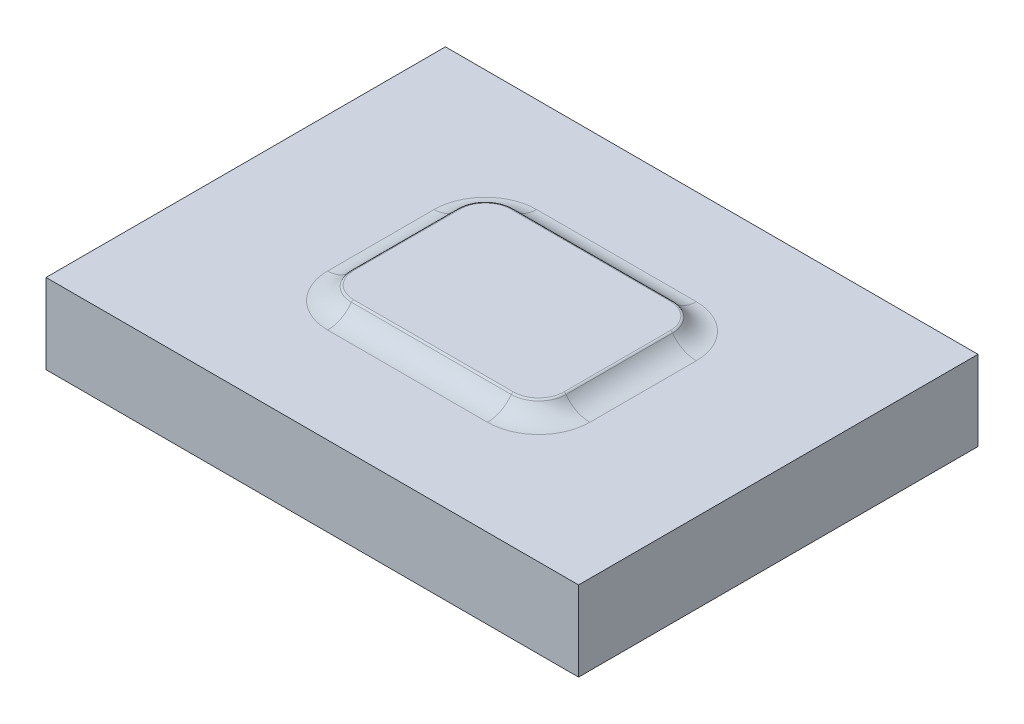
ISO-10303-21;
HEADER;
FILE_DESCRIPTION(('STEP AP214'),'2;1');
FILE_NAME('part.step','',(''),(''),'','','');
FILE_SCHEMA(('AUTOMOTIVE_DESIGN { 1 0 10303 214 1 1 1 1 }'));
ENDSEC;
DATA;
#1=APPLICATION_CONTEXT('core data for automotive mechanical design processes');
#2=APPLICATION_PROTOCOL_DEFINITION('international standard','automotive_design',2000,#1);
#3=PRODUCT_CONTEXT('',#1,'mechanical');
#4=PRODUCT('Part','Part','',(#3));
#5=PRODUCT_RELATED_PRODUCT_CATEGORY('part','',(#4));
#6=PRODUCT_DEFINITION_FORMATION('','',#4);
#7=PRODUCT_DEFINITION_CONTEXT('part definition',#1,'design');
#8=PRODUCT_DEFINITION('design','',#6,#7);
#9=PRODUCT_DEFINITION_SHAPE('','',#8);
#10=(LENGTH_UNIT() NAMED_UNIT(*) SI_UNIT(.MILLI.,.METRE.));
#11=(NAMED_UNIT(*) PLANE_ANGLE_UNIT() SI_UNIT($,.RADIAN.));
#12=(NAMED_UNIT(*) SI_UNIT($,.STERADIAN.) SOLID_ANGLE_UNIT());
#13=UNCERTAINTY_MEASURE_WITH_UNIT(LENGTH_MEASURE(1.E-05),#10,'distance_accuracy_value','');
#14=(GEOMETRIC_REPRESENTATION_CONTEXT(3) GLOBAL_UNCERTAINTY_ASSIGNED_CONTEXT((#13)) GLOBAL_UNIT_ASSIGNED_CONTEXT((#10,
#11,#12)) REPRESENTATION_CONTEXT('',''));
#15=CARTESIAN_POINT('',(0.,0.,0.));
#16=DIRECTION('',(0.,0.,1.));
#17=DIRECTION('',(1.,0.,0.));
#18=AXIS2_PLACEMENT_3D('',#15,#16,#17);
#19=CARTESIAN_POINT('',(0.,3.,0.));
#20=DIRECTION('',(0.,-1.,0.));
#21=DIRECTION('',(0.,0.,-1.));
#22=AXIS2_PLACEMENT_3D('',#19,#20,#21);
#23=PLANE('',#22);
#24=DIRECTION('',(0.,0.,1.));
#25=VECTOR('',#24,1.);
#26=CARTESIAN_POINT('',(4.92195444572929,3.,0.));
#27=LINE('',#26,#25);
#28=CARTESIAN_POINT('',(4.92195444572929,3.,-2.));
#29=VERTEX_POINT('',#28);
#30=CARTESIAN_POINT('',(4.92195444572929,3.,2.));
#31=VERTEX_POINT('',#30);
#32=EDGE_CURVE('E182',#29,#31,#27,.T.);
#33=ORIENTED_EDGE('',*,*,#32,.T.);
#34=CARTESIAN_POINT('',(3.,3.,2.));
#35=DIRECTION('',(0.,-1.,0.));
#36=DIRECTION('',(0.,0.,-1.));
#37=AXIS2_PLACEMENT_3D('',#34,#35,#36);
#38=CIRCLE('',#37,1.92195444572929);
#39=CARTESIAN_POINT('',(3.,3.,3.92195444572929));
#40=VERTEX_POINT('',#39);
#41=EDGE_CURVE('E204',#31,#40,#38,.T.);
#42=ORIENTED_EDGE('',*,*,#41,.T.);
#43=DIRECTION('',(-1.,0.,0.));
#44=VECTOR('',#43,1.);
#45=CARTESIAN_POINT('',(0.,3.,3.92195444572929));
#46=LINE('',#45,#44);
#47=CARTESIAN_POINT('',(-3.,3.,3.92195444572929));
#48=VERTEX_POINT('',#47);
#49=EDGE_CURVE('E201',#40,#48,#46,.T.);
#50=ORIENTED_EDGE('',*,*,#49,.T.);
#51=CARTESIAN_POINT('',(-3.,3.,2.));
#52=DIRECTION('',(0.,-1.,0.));
#53=DIRECTION('',(0.,0.,-1.));
#54=AXIS2_PLACEMENT_3D('',#51,#52,#53);
#55=CIRCLE('',#54,1.92195444572929);
#56=CARTESIAN_POINT('',(-4.92195444572929,3.,2.));
#57=VERTEX_POINT('',#56);
#58=EDGE_CURVE('E198',#48,#57,#55,.T.);
#59=ORIENTED_EDGE('',*,*,#58,.T.);
#60=DIRECTION('',(0.,0.,-1.));
#61=VECTOR('',#60,1.);
#62=CARTESIAN_POINT('',(-4.92195444572929,3.,0.));
#63=LINE('',#62,#61);
#64=CARTESIAN_POINT('',(-4.92195444572929,3.,-2.));
#65=VERTEX_POINT('',#64);
#66=EDGE_CURVE('E195',#57,#65,#63,.T.);
#67=ORIENTED_EDGE('',*,*,#66,.T.);
#68=CARTESIAN_POINT('',(-3.,3.,-2.));
#69=DIRECTION('',(0.,-1.,0.));
#70=DIRECTION('',(0.,0.,-1.));
#71=AXIS2_PLACEMENT_3D('',#68,#69,#70);
#72=CIRCLE('',#71,1.92195444572929);
#73=CARTESIAN_POINT('',(-3.,3.,-3.92195444572929));
#74=VERTEX_POINT('',#73);
#75=EDGE_CURVE('E193',#65,#74,#72,.T.);
#76=ORIENTED_EDGE('',*,*,#75,.T.);
#77=DIRECTION('',(1.,0.,0.));
#78=VECTOR('',#77,1.);
#79=CARTESIAN_POINT('',(0.,3.,-3.92195444572929));
#80=LINE('',#79,#78);
#81=CARTESIAN_POINT('',(3.,3.,-3.92195444572929));
#82=VERTEX_POINT('',#81);
#83=EDGE_CURVE('E191',#74,#82,#80,.T.);
#84=ORIENTED_EDGE('',*,*,#83,.T.);
#85=CARTESIAN_POINT('',(3.,3.,-2.));
#86=DIRECTION('',(0.,-1.,0.));
#87=DIRECTION('',(0.,0.,-1.));
#88=AXIS2_PLACEMENT_3D('',#85,#86,#87);
#89=CIRCLE('',#88,1.92195444572929);
#90=EDGE_CURVE('E184',#82,#29,#89,.T.);
#91=ORIENTED_EDGE('',*,*,#90,.T.);
#92=EDGE_LOOP('',(#33,#42,#50,#59,#67,#76,#84,#91));
#93=FACE_BOUND('',#92,.T.);
#94=DIRECTION('',(0.,0.,1.));
#95=VECTOR('',#94,1.);
#96=CARTESIAN_POINT('',(-10.,3.,-7.5));
#97=LINE('',#96,#95);
#98=CARTESIAN_POINT('',(-10.,3.,-7.5));
#99=VERTEX_POINT('',#98);
#100=CARTESIAN_POINT('',(-10.,3.,7.5));
#101=VERTEX_POINT('',#100);
#102=EDGE_CURVE('E169',#99,#101,#97,.T.);
#103=ORIENTED_EDGE('',*,*,#102,.T.);
#104=DIRECTION('',(1.,0.,0.));
#105=VECTOR('',#104,1.);
#106=CARTESIAN_POINT('',(10.,3.,7.5));
#107=LINE('',#106,#105);
#108=CARTESIAN_POINT('',(10.,3.,7.5));
#109=VERTEX_POINT('',#108);
#110=EDGE_CURVE('E158',#101,#109,#107,.T.);
#111=ORIENTED_EDGE('',*,*,#110,.T.);
#112=DIRECTION('',(0.,0.,-1.));
#113=VECTOR('',#112,1.);
#114=CARTESIAN_POINT('',(10.,3.,-7.5));
#115=LINE('',#114,#113);
#116=CARTESIAN_POINT('',(10.,3.,-7.5));
#117=VERTEX_POINT('',#116);
#118=EDGE_CURVE('E168',#109,#117,#115,.T.);
#119=ORIENTED_EDGE('',*,*,#118,.T.);
#120=DIRECTION('',(-1.,0.,0.));
#121=VECTOR('',#120,1.);
#122=CARTESIAN_POINT('',(10.,3.,-7.5));
#123=LINE('',#122,#121);
#124=EDGE_CURVE('E173',#117,#99,#123,.T.);
#125=ORIENTED_EDGE('',*,*,#124,.T.);
#126=EDGE_LOOP('',(#103,#111,#119,#125));
#127=FACE_BOUND('',#126,.T.);
#128=ADVANCED_FACE('F42',(#93,#127),#23,.F.);
#129=CARTESIAN_POINT('',(-10.,3.,-7.5));
#130=DIRECTION('',(1.,0.,0.));
#131=DIRECTION('',(0.,0.,-1.));
#132=AXIS2_PLACEMENT_3D('',#129,#130,#131);
#133=PLANE('',#132);
#134=DIRECTION('',(0.,0.,1.));
#135=VECTOR('',#134,1.);
#136=CARTESIAN_POINT('',(-10.,0.,-7.5));
#137=LINE('',#136,#135);
#138=CARTESIAN_POINT('',(-10.,0.,-7.5));
#139=VERTEX_POINT('',#138);
#140=CARTESIAN_POINT('',(-10.,0.,7.5));
#141=VERTEX_POINT('',#140);
#142=EDGE_CURVE('E181',#139,#141,#137,.T.);
#143=ORIENTED_EDGE('',*,*,#142,.T.);
#144=DIRECTION('',(0.,-1.,0.));
#145=VECTOR('',#144,1.);
#146=CARTESIAN_POINT('',(-10.,3.,7.5));
#147=LINE('',#146,#145);
#148=EDGE_CURVE('E162',#101,#141,#147,.T.);
#149=ORIENTED_EDGE('',*,*,#148,.F.);
#150=ORIENTED_EDGE('',*,*,#102,.F.);
#151=DIRECTION('',(0.,-1.,0.));
#152=VECTOR('',#151,1.);
#153=CARTESIAN_POINT('',(-10.,3.,-7.5));
#154=LINE('',#153,#152);
#155=EDGE_CURVE('E589',#99,#139,#154,.T.);
#156=ORIENTED_EDGE('',*,*,#155,.T.);
#157=EDGE_LOOP('',(#143,#149,#150,#156));
#158=FACE_BOUND('',#157,.T.);
#159=ADVANCED_FACE('F179',(#158),#133,.F.);
#160=CARTESIAN_POINT('',(10.,3.,7.5));
#161=DIRECTION('',(0.,0.,-1.));
#162=DIRECTION('',(-1.,0.,0.));
#163=AXIS2_PLACEMENT_3D('',#160,#161,#162);
#164=PLANE('',#163);
#165=DIRECTION('',(1.,0.,0.));
#166=VECTOR('',#165,1.);
#167=CARTESIAN_POINT('',(10.,0.,7.5));
#168=LINE('',#167,#166);
#169=CARTESIAN_POINT('',(10.,0.,7.5));
#170=VERTEX_POINT('',#169);
#171=EDGE_CURVE('E587',#141,#170,#168,.T.);
#172=ORIENTED_EDGE('',*,*,#171,.T.);
#173=DIRECTION('',(0.,-1.,0.));
#174=VECTOR('',#173,1.);
#175=CARTESIAN_POINT('',(10.,3.,7.5));
#176=LINE('',#175,#174);
#177=EDGE_CURVE('E165',#109,#170,#176,.T.);
#178=ORIENTED_EDGE('',*,*,#177,.F.);
#179=ORIENTED_EDGE('',*,*,#110,.F.);
#180=ORIENTED_EDGE('',*,*,#148,.T.);
#181=EDGE_LOOP('',(#172,#178,#179,#180));
#182=FACE_BOUND('',#181,.T.);
#183=ADVANCED_FACE('F160',(#182),#164,.F.);
#184=CARTESIAN_POINT('',(10.,3.,-7.5));
#185=DIRECTION('',(-1.,0.,0.));
#186=DIRECTION('',(0.,0.,1.));
#187=AXIS2_PLACEMENT_3D('',#184,#185,#186);
#188=PLANE('',#187);
#189=DIRECTION('',(0.,0.,-1.));
#190=VECTOR('',#189,1.);
#191=CARTESIAN_POINT('',(10.,0.,-7.5));
#192=LINE('',#191,#190);
#193=CARTESIAN_POINT('',(10.,0.,-7.5));
#194=VERTEX_POINT('',#193);
#195=EDGE_CURVE('E584',#170,#194,#192,.T.);
#196=ORIENTED_EDGE('',*,*,#195,.T.);
#197=DIRECTION('',(0.,-1.,0.));
#198=VECTOR('',#197,1.);
#199=CARTESIAN_POINT('',(10.,3.,-7.5));
#200=LINE('',#199,#198);
#201=EDGE_CURVE('E186',#117,#194,#200,.T.);
#202=ORIENTED_EDGE('',*,*,#201,.F.);
#203=ORIENTED_EDGE('',*,*,#118,.F.);
#204=ORIENTED_EDGE('',*,*,#177,.T.);
#205=EDGE_LOOP('',(#196,#202,#203,#204));
#206=FACE_BOUND('',#205,.T.);
#207=ADVANCED_FACE('F358',(#206),#188,.F.);
#208=CARTESIAN_POINT('',(10.,3.,-7.5));
#209=DIRECTION('',(0.,0.,1.));
#210=DIRECTION('',(1.,0.,0.));
#211=AXIS2_PLACEMENT_3D('',#208,#209,#210);
#212=PLANE('',#211);
#213=DIRECTION('',(-1.,0.,0.));
#214=VECTOR('',#213,1.);
#215=CARTESIAN_POINT('',(10.,0.,-7.5));
#216=LINE('',#215,#214);
#217=EDGE_CURVE('E177',#194,#139,#216,.T.);
#218=ORIENTED_EDGE('',*,*,#217,.T.);
#219=ORIENTED_EDGE('',*,*,#155,.F.);
#220=ORIENTED_EDGE('',*,*,#124,.F.);
#221=ORIENTED_EDGE('',*,*,#201,.T.);
#222=EDGE_LOOP('',(#218,#219,#220,#221));
#223=FACE_BOUND('',#222,.T.);
#224=ADVANCED_FACE('F354',(#223),#212,.F.);
#225=CARTESIAN_POINT('',(0.,0.,0.));
#226=DIRECTION('',(0.,-1.,0.));
#227=DIRECTION('',(0.,0.,-1.));
#228=AXIS2_PLACEMENT_3D('',#225,#226,#227);
#229=PLANE('',#228);
#230=ORIENTED_EDGE('',*,*,#142,.F.);
#231=ORIENTED_EDGE('',*,*,#217,.F.);
#232=ORIENTED_EDGE('',*,*,#195,.F.);
#233=ORIENTED_EDGE('',*,*,#171,.F.);
#234=EDGE_LOOP('',(#230,#231,#232,#233));
#235=FACE_BOUND('',#234,.T.);
#236=ADVANCED_FACE('F351',(#235),#229,.T.);
#237=CARTESIAN_POINT('',(0.,3.5,0.));
#238=DIRECTION('',(0.,-1.,0.));
#239=DIRECTION('',(0.,0.,-1.));
#240=AXIS2_PLACEMENT_3D('',#237,#238,#239);
#241=PLANE('',#240);
#242=DIRECTION('',(-1.,0.,0.));
#243=VECTOR('',#242,1.);
#244=CARTESIAN_POINT('',(0.,3.5,2.94727501124839));
#245=LINE('',#244,#243);
#246=CARTESIAN_POINT('',(-3.,3.5,2.94727501124839));
#247=VERTEX_POINT('',#246);
#248=CARTESIAN_POINT('',(3.,3.5,2.94727501124839));
#249=VERTEX_POINT('',#248);
#250=EDGE_CURVE('E236',#247,#249,#245,.F.);
#251=ORIENTED_EDGE('',*,*,#250,.T.);
#252=CARTESIAN_POINT('',(3.,3.5,2.));
#253=DIRECTION('',(0.,-1.,0.));
#254=DIRECTION('',(0.,0.,-1.));
#255=AXIS2_PLACEMENT_3D('',#252,#253,#254);
#256=CIRCLE('',#255,0.947275011248392);
#257=CARTESIAN_POINT('',(3.94727501124839,3.5,2.));
#258=VERTEX_POINT('',#257);
#259=EDGE_CURVE('E238',#249,#258,#256,.F.);
#260=ORIENTED_EDGE('',*,*,#259,.T.);
#261=DIRECTION('',(0.,0.,1.));
#262=VECTOR('',#261,1.);
#263=CARTESIAN_POINT('',(3.94727501124839,3.5,0.));
#264=LINE('',#263,#262);
#265=CARTESIAN_POINT('',(3.94727501124839,3.5,-2.));
#266=VERTEX_POINT('',#265);
#267=EDGE_CURVE('E207',#258,#266,#264,.F.);
#268=ORIENTED_EDGE('',*,*,#267,.T.);
#269=CARTESIAN_POINT('',(3.,3.5,-2.));
#270=DIRECTION('',(0.,-1.,0.));
#271=DIRECTION('',(0.,0.,-1.));
#272=AXIS2_PLACEMENT_3D('',#269,#270,#271);
#273=CIRCLE('',#272,0.947275011248392);
#274=CARTESIAN_POINT('',(3.,3.5,-2.94727501124839));
#275=VERTEX_POINT('',#274);
#276=EDGE_CURVE('E226',#266,#275,#273,.F.);
#277=ORIENTED_EDGE('',*,*,#276,.T.);
#278=DIRECTION('',(1.,0.,0.));
#279=VECTOR('',#278,1.);
#280=CARTESIAN_POINT('',(0.,3.5,-2.94727501124839));
#281=LINE('',#280,#279);
#282=CARTESIAN_POINT('',(-3.,3.5,-2.94727501124839));
#283=VERTEX_POINT('',#282);
#284=EDGE_CURVE('E228',#275,#283,#281,.F.);
#285=ORIENTED_EDGE('',*,*,#284,.T.);
#286=CARTESIAN_POINT('',(-3.,3.5,-2.));
#287=DIRECTION('',(0.,-1.,0.));
#288=DIRECTION('',(0.,0.,-1.));
#289=AXIS2_PLACEMENT_3D('',#286,#287,#288);
#290=CIRCLE('',#289,0.947275011248392);
#291=CARTESIAN_POINT('',(-3.94727501124839,3.5,-2.));
#292=VERTEX_POINT('',#291);
#293=EDGE_CURVE('E230',#283,#292,#290,.F.);
#294=ORIENTED_EDGE('',*,*,#293,.T.);
#295=DIRECTION('',(0.,0.,-1.));
#296=VECTOR('',#295,1.);
#297=CARTESIAN_POINT('',(-3.94727501124839,3.5,0.));
#298=LINE('',#297,#296);
#299=CARTESIAN_POINT('',(-3.94727501124839,3.5,2.));
#300=VERTEX_POINT('',#299);
#301=EDGE_CURVE('E232',#292,#300,#298,.F.);
#302=ORIENTED_EDGE('',*,*,#301,.T.);
#303=CARTESIAN_POINT('',(-3.,3.5,2.));
#304=DIRECTION('',(0.,-1.,0.));
#305=DIRECTION('',(0.,0.,-1.));
#306=AXIS2_PLACEMENT_3D('',#303,#304,#305);
#307=CIRCLE('',#306,0.947275011248392);
#308=EDGE_CURVE('E234',#300,#247,#307,.F.);
#309=ORIENTED_EDGE('',*,*,#308,.T.);
#310=EDGE_LOOP('',(#251,#260,#268,#277,#285,#294,#302,#309));
#311=FACE_BOUND('',#310,.T.);
#312=ADVANCED_FACE('F313',(#311),#241,.F.);
#313=CARTESIAN_POINT('',(-3.,4.1,-2.));
#314=DIRECTION('',(0.,-1.,0.));
#315=DIRECTION('',(0.,0.,-1.));
#316=AXIS2_PLACEMENT_3D('',#313,#314,#315);
#317=TOROIDAL_SURFACE('',#316,1.92195444572929,1.1);
#318=CARTESIAN_POINT('',(-4.92195444573013,4.1,-2.));
#319=DIRECTION('',(0.,0.,-1.));
#320=DIRECTION('',(-1.,0.,0.));
#321=AXIS2_PLACEMENT_3D('',#318,#319,#320);
#322=CIRCLE('',#321,1.1);
#323=CARTESIAN_POINT('',(-4.02849829745568,3.45833333333373,-2.));
#324=VERTEX_POINT('',#323);
#325=EDGE_CURVE('E221',#324,#65,#322,.T.);
#326=ORIENTED_EDGE('',*,*,#325,.F.);
#327=CARTESIAN_POINT('',(-3.,3.45833333333333,-2.));
#328=DIRECTION('',(0.,1.,0.));
#329=DIRECTION('',(0.,0.,1.));
#330=AXIS2_PLACEMENT_3D('',#327,#328,#329);
#331=CIRCLE('',#330,1.02849829745513);
#332=CARTESIAN_POINT('',(-3.,3.45833333333333,-3.02849829745513));
#333=VERTEX_POINT('',#332);
#334=EDGE_CURVE('E250',#324,#333,#331,.F.);
#335=ORIENTED_EDGE('',*,*,#334,.T.);
#336=CARTESIAN_POINT('',(-3.,4.1,-3.92195444572929));
#337=DIRECTION('',(-1.,0.,0.));
#338=DIRECTION('',(0.,0.,1.));
#339=AXIS2_PLACEMENT_3D('',#336,#337,#338);
#340=CIRCLE('',#339,1.1);
#341=EDGE_CURVE('E223',#74,#333,#340,.T.);
#342=ORIENTED_EDGE('',*,*,#341,.F.);
#343=ORIENTED_EDGE('',*,*,#75,.F.);
#344=EDGE_LOOP('',(#326,#335,#342,#343));
#345=FACE_BOUND('',#344,.T.);
#346=ADVANCED_FACE('F287',(#345),#317,.F.);
#347=CARTESIAN_POINT('',(4.,4.1,-3.92195444572929));
#348=DIRECTION('',(1.,0.,0.));
#349=DIRECTION('',(0.,0.,-1.));
#350=AXIS2_PLACEMENT_3D('',#347,#348,#349);
#351=CYLINDRICAL_SURFACE('',#350,1.1);
#352=ORIENTED_EDGE('',*,*,#341,.T.);
#353=DIRECTION('',(1.,0.,0.));
#354=VECTOR('',#353,1.);
#355=CARTESIAN_POINT('',(4.,3.45833333333333,-3.02849829745513));
#356=LINE('',#355,#354);
#357=CARTESIAN_POINT('',(3.,3.45833333333333,-3.02849829745513));
#358=VERTEX_POINT('',#357);
#359=EDGE_CURVE('E66',#333,#358,#356,.T.);
#360=ORIENTED_EDGE('',*,*,#359,.T.);
#361=CARTESIAN_POINT('',(3.,4.1,-3.92195444572929));
#362=DIRECTION('',(-1.,0.,0.));
#363=DIRECTION('',(0.,0.,1.));
#364=AXIS2_PLACEMENT_3D('',#361,#362,#363);
#365=CIRCLE('',#364,1.1);
#366=EDGE_CURVE('E219',#82,#358,#365,.T.);
#367=ORIENTED_EDGE('',*,*,#366,.F.);
#368=ORIENTED_EDGE('',*,*,#83,.F.);
#369=EDGE_LOOP('',(#352,#360,#367,#368));
#370=FACE_BOUND('',#369,.T.);
#371=ADVANCED_FACE('F290',(#370),#351,.F.);
#372=CARTESIAN_POINT('',(-4.92195444572929,4.1,-3.));
#373=DIRECTION('',(0.,0.,-1.));
#374=DIRECTION('',(-1.,0.,0.));
#375=AXIS2_PLACEMENT_3D('',#372,#373,#374);
#376=CYLINDRICAL_SURFACE('',#375,1.1);
#377=CARTESIAN_POINT('',(-4.92195444573012,4.1,2.));
#378=DIRECTION('',(0.,0.,-1.));
#379=DIRECTION('',(-1.,0.,0.));
#380=AXIS2_PLACEMENT_3D('',#377,#378,#379);
#381=CIRCLE('',#380,1.1);
#382=CARTESIAN_POINT('',(-4.02849829745568,3.45833333333373,2.));
#383=VERTEX_POINT('',#382);
#384=EDGE_CURVE('E217',#383,#57,#381,.T.);
#385=ORIENTED_EDGE('',*,*,#384,.F.);
#386=DIRECTION('',(0.,0.,-1.));
#387=VECTOR('',#386,1.);
#388=CARTESIAN_POINT('',(-4.02849829745513,3.45833333333333,-3.));
#389=LINE('',#388,#387);
#390=EDGE_CURVE('E248',#383,#324,#389,.T.);
#391=ORIENTED_EDGE('',*,*,#390,.T.);
#392=ORIENTED_EDGE('',*,*,#325,.T.);
#393=ORIENTED_EDGE('',*,*,#66,.F.);
#394=EDGE_LOOP('',(#385,#391,#392,#393));
#395=FACE_BOUND('',#394,.T.);
#396=ADVANCED_FACE('F297',(#395),#376,.F.);
#397=CARTESIAN_POINT('',(3.,4.1,-2.));
#398=DIRECTION('',(0.,-1.,0.));
#399=DIRECTION('',(0.,0.,-1.));
#400=AXIS2_PLACEMENT_3D('',#397,#398,#399);
#401=TOROIDAL_SURFACE('',#400,1.92195444572929,1.1);
#402=ORIENTED_EDGE('',*,*,#366,.T.);
#403=CARTESIAN_POINT('',(3.,3.45833333333333,-2.));
#404=DIRECTION('',(0.,1.,0.));
#405=DIRECTION('',(0.,0.,1.));
#406=AXIS2_PLACEMENT_3D('',#403,#404,#405);
#407=CIRCLE('',#406,1.02849829745513);
#408=CARTESIAN_POINT('',(4.02849829745513,3.45833333333333,-2.));
#409=VERTEX_POINT('',#408);
#410=EDGE_CURVE('E51',#358,#409,#407,.F.);
#411=ORIENTED_EDGE('',*,*,#410,.T.);
#412=CARTESIAN_POINT('',(4.92195444572929,4.1,-2.));
#413=DIRECTION('',(0.,0.,-1.));
#414=DIRECTION('',(-1.,0.,0.));
#415=AXIS2_PLACEMENT_3D('',#412,#413,#414);
#416=CIRCLE('',#415,1.1);
#417=EDGE_CURVE('E215',#29,#409,#416,.T.);
#418=ORIENTED_EDGE('',*,*,#417,.F.);
#419=ORIENTED_EDGE('',*,*,#90,.F.);
#420=EDGE_LOOP('',(#402,#411,#418,#419));
#421=FACE_BOUND('',#420,.T.);
#422=ADVANCED_FACE('F375',(#421),#401,.F.);
#423=CARTESIAN_POINT('',(-3.,4.1,2.));
#424=DIRECTION('',(0.,-1.,0.));
#425=DIRECTION('',(0.,0.,-1.));
#426=AXIS2_PLACEMENT_3D('',#423,#424,#425);
#427=TOROIDAL_SURFACE('',#426,1.92195444572929,1.1);
#428=CARTESIAN_POINT('',(-3.,4.1,3.92195444573013));
#429=DIRECTION('',(-1.,0.,0.));
#430=DIRECTION('',(0.,0.,1.));
#431=AXIS2_PLACEMENT_3D('',#428,#429,#430);
#432=CIRCLE('',#431,1.1);
#433=CARTESIAN_POINT('',(-3.,3.45833333333373,3.02849829745569));
#434=VERTEX_POINT('',#433);
#435=EDGE_CURVE('E213',#434,#48,#432,.T.);
#436=ORIENTED_EDGE('',*,*,#435,.F.);
#437=CARTESIAN_POINT('',(-3.,3.45833333333333,2.));
#438=DIRECTION('',(0.,1.,0.));
#439=DIRECTION('',(0.,0.,1.));
#440=AXIS2_PLACEMENT_3D('',#437,#438,#439);
#441=CIRCLE('',#440,1.02849829745513);
#442=EDGE_CURVE('E246',#434,#383,#441,.F.);
#443=ORIENTED_EDGE('',*,*,#442,.T.);
#444=ORIENTED_EDGE('',*,*,#384,.T.);
#445=ORIENTED_EDGE('',*,*,#58,.F.);
#446=EDGE_LOOP('',(#436,#443,#444,#445));
#447=FACE_BOUND('',#446,.T.);
#448=ADVANCED_FACE('F300',(#447),#427,.F.);
#449=CARTESIAN_POINT('',(4.92195444572929,4.1,-3.));
#450=DIRECTION('',(0.,0.,1.));
#451=DIRECTION('',(1.,0.,0.));
#452=AXIS2_PLACEMENT_3D('',#449,#450,#451);
#453=CYLINDRICAL_SURFACE('',#452,1.1);
#454=ORIENTED_EDGE('',*,*,#417,.T.);
#455=DIRECTION('',(0.,0.,1.));
#456=VECTOR('',#455,1.);
#457=CARTESIAN_POINT('',(4.02849829745513,3.45833333333333,-3.));
#458=LINE('',#457,#456);
#459=CARTESIAN_POINT('',(4.02849829745513,3.45833333333333,2.));
#460=VERTEX_POINT('',#459);
#461=EDGE_CURVE('E12',#409,#460,#458,.T.);
#462=ORIENTED_EDGE('',*,*,#461,.T.);
#463=CARTESIAN_POINT('',(4.92195444572929,4.1,2.));
#464=DIRECTION('',(0.,0.,-1.));
#465=DIRECTION('',(-1.,0.,0.));
#466=AXIS2_PLACEMENT_3D('',#463,#464,#465);
#467=CIRCLE('',#466,1.1);
#468=EDGE_CURVE('E210',#31,#460,#467,.T.);
#469=ORIENTED_EDGE('',*,*,#468,.F.);
#470=ORIENTED_EDGE('',*,*,#32,.F.);
#471=EDGE_LOOP('',(#454,#462,#469,#470));
#472=FACE_BOUND('',#471,.T.);
#473=ADVANCED_FACE('F327',(#472),#453,.F.);
#474=CARTESIAN_POINT('',(4.,4.1,3.92195444572929));
#475=DIRECTION('',(-1.,0.,0.));
#476=DIRECTION('',(0.,0.,1.));
#477=AXIS2_PLACEMENT_3D('',#474,#475,#476);
#478=CYLINDRICAL_SURFACE('',#477,1.1);
#479=CARTESIAN_POINT('',(3.,4.1,3.92195444573012));
#480=DIRECTION('',(-1.,0.,0.));
#481=DIRECTION('',(0.,0.,1.));
#482=AXIS2_PLACEMENT_3D('',#479,#480,#481);
#483=CIRCLE('',#482,1.1);
#484=CARTESIAN_POINT('',(3.,3.45833333333373,3.02849829745569));
#485=VERTEX_POINT('',#484);
#486=EDGE_CURVE('E208',#485,#40,#483,.T.);
#487=ORIENTED_EDGE('',*,*,#486,.F.);
#488=DIRECTION('',(-1.,0.,0.));
#489=VECTOR('',#488,1.);
#490=CARTESIAN_POINT('',(4.,3.45833333333333,3.02849829745513));
#491=LINE('',#490,#489);
#492=EDGE_CURVE('E244',#485,#434,#491,.T.);
#493=ORIENTED_EDGE('',*,*,#492,.T.);
#494=ORIENTED_EDGE('',*,*,#435,.T.);
#495=ORIENTED_EDGE('',*,*,#49,.F.);
#496=EDGE_LOOP('',(#487,#493,#494,#495));
#497=FACE_BOUND('',#496,.T.);
#498=ADVANCED_FACE('F367',(#497),#478,.F.);
#499=CARTESIAN_POINT('',(3.,4.1,2.));
#500=DIRECTION('',(0.,-1.,0.));
#501=DIRECTION('',(0.,0.,-1.));
#502=AXIS2_PLACEMENT_3D('',#499,#500,#501);
#503=TOROIDAL_SURFACE('',#502,1.92195444572929,1.1);
#504=ORIENTED_EDGE('',*,*,#468,.T.);
#505=CARTESIAN_POINT('',(3.,3.45833333333333,2.));
#506=DIRECTION('',(0.,1.,0.));
#507=DIRECTION('',(0.,0.,1.));
#508=AXIS2_PLACEMENT_3D('',#505,#506,#507);
#509=CIRCLE('',#508,1.02849829745513);
#510=EDGE_CURVE('E241',#460,#485,#509,.F.);
#511=ORIENTED_EDGE('',*,*,#510,.T.);
#512=ORIENTED_EDGE('',*,*,#486,.T.);
#513=ORIENTED_EDGE('',*,*,#41,.F.);
#514=EDGE_LOOP('',(#504,#511,#512,#513));
#515=FACE_BOUND('',#514,.T.);
#516=ADVANCED_FACE('F332',(#515),#503,.F.);
#517=CARTESIAN_POINT('',(-3.,3.4,-2.));
#518=DIRECTION('',(0.,1.,0.));
#519=DIRECTION('',(0.,0.,1.));
#520=AXIS2_PLACEMENT_3D('',#517,#518,#519);
#521=TOROIDAL_SURFACE('',#520,0.947275011248392,0.1);
#522=CARTESIAN_POINT('',(-3.,3.4,-2.94727501124839));
#523=DIRECTION('',(1.,0.,0.));
#524=DIRECTION('',(0.,0.,-1.));
#525=AXIS2_PLACEMENT_3D('',#522,#523,#524);
#526=CIRCLE('',#525,0.1);
#527=EDGE_CURVE('E269',#333,#283,#526,.T.);
#528=ORIENTED_EDGE('',*,*,#527,.F.);
#529=ORIENTED_EDGE('',*,*,#334,.F.);
#530=CARTESIAN_POINT('',(-3.94727501124839,3.4,-2.));
#531=DIRECTION('',(0.,0.,1.));
#532=DIRECTION('',(1.,0.,0.));
#533=AXIS2_PLACEMENT_3D('',#530,#531,#532);
#534=CIRCLE('',#533,0.1);
#535=EDGE_CURVE('E46',#292,#324,#534,.T.);
#536=ORIENTED_EDGE('',*,*,#535,.F.);
#537=ORIENTED_EDGE('',*,*,#293,.F.);
#538=EDGE_LOOP('',(#528,#529,#536,#537));
#539=FACE_BOUND('',#538,.T.);
#540=ADVANCED_FACE('F44',(#539),#521,.T.);
#541=CARTESIAN_POINT('',(-3.94727501124839,3.4,-3.));
#542=DIRECTION('',(0.,0.,-1.));
#543=DIRECTION('',(-1.,0.,0.));
#544=AXIS2_PLACEMENT_3D('',#541,#542,#543);
#545=CYLINDRICAL_SURFACE('',#544,0.1);
#546=ORIENTED_EDGE('',*,*,#535,.T.);
#547=ORIENTED_EDGE('',*,*,#390,.F.);
#548=CARTESIAN_POINT('',(-3.94727501124839,3.4,2.));
#549=DIRECTION('',(0.,0.,1.));
#550=DIRECTION('',(1.,0.,0.));
#551=AXIS2_PLACEMENT_3D('',#548,#549,#550);
#552=CIRCLE('',#551,0.1);
#553=EDGE_CURVE('E267',#300,#383,#552,.T.);
#554=ORIENTED_EDGE('',*,*,#553,.F.);
#555=ORIENTED_EDGE('',*,*,#301,.F.);
#556=EDGE_LOOP('',(#546,#547,#554,#555));
#557=FACE_BOUND('',#556,.T.);
#558=ADVANCED_FACE('F279',(#557),#545,.T.);
#559=CARTESIAN_POINT('',(4.,3.4,-2.94727501124839));
#560=DIRECTION('',(1.,0.,0.));
#561=DIRECTION('',(0.,0.,-1.));
#562=AXIS2_PLACEMENT_3D('',#559,#560,#561);
#563=CYLINDRICAL_SURFACE('',#562,0.1);
#564=ORIENTED_EDGE('',*,*,#527,.T.);
#565=ORIENTED_EDGE('',*,*,#284,.F.);
#566=CARTESIAN_POINT('',(3.,3.4,-2.94727501124839));
#567=DIRECTION('',(1.,0.,0.));
#568=DIRECTION('',(0.,0.,-1.));
#569=AXIS2_PLACEMENT_3D('',#566,#567,#568);
#570=CIRCLE('',#569,0.1);
#571=EDGE_CURVE('E264',#358,#275,#570,.T.);
#572=ORIENTED_EDGE('',*,*,#571,.F.);
#573=ORIENTED_EDGE('',*,*,#359,.F.);
#574=EDGE_LOOP('',(#564,#565,#572,#573));
#575=FACE_BOUND('',#574,.T.);
#576=ADVANCED_FACE('F316',(#575),#563,.T.);
#577=CARTESIAN_POINT('',(-3.,3.4,2.));
#578=DIRECTION('',(0.,1.,0.));
#579=DIRECTION('',(0.,0.,1.));
#580=AXIS2_PLACEMENT_3D('',#577,#578,#579);
#581=TOROIDAL_SURFACE('',#580,0.947275011248392,0.1);
#582=ORIENTED_EDGE('',*,*,#553,.T.);
#583=ORIENTED_EDGE('',*,*,#442,.F.);
#584=CARTESIAN_POINT('',(-3.,3.4,2.94727501124839));
#585=DIRECTION('',(1.,0.,0.));
#586=DIRECTION('',(0.,0.,-1.));
#587=AXIS2_PLACEMENT_3D('',#584,#585,#586);
#588=CIRCLE('',#587,0.1);
#589=EDGE_CURVE('E261',#247,#434,#588,.T.);
#590=ORIENTED_EDGE('',*,*,#589,.F.);
#591=ORIENTED_EDGE('',*,*,#308,.F.);
#592=EDGE_LOOP('',(#582,#583,#590,#591));
#593=FACE_BOUND('',#592,.T.);
#594=ADVANCED_FACE('F304',(#593),#581,.T.);
#595=CARTESIAN_POINT('',(3.,3.4,-2.));
#596=DIRECTION('',(0.,1.,0.));
#597=DIRECTION('',(0.,0.,1.));
#598=AXIS2_PLACEMENT_3D('',#595,#596,#597);
#599=TOROIDAL_SURFACE('',#598,0.947275011248392,0.1);
#600=ORIENTED_EDGE('',*,*,#571,.T.);
#601=ORIENTED_EDGE('',*,*,#276,.F.);
#602=CARTESIAN_POINT('',(3.94727501124839,3.4,-2.));
#603=DIRECTION('',(0.,0.,1.));
#604=DIRECTION('',(1.,0.,0.));
#605=AXIS2_PLACEMENT_3D('',#602,#603,#604);
#606=CIRCLE('',#605,0.1);
#607=EDGE_CURVE('E258',#409,#266,#606,.T.);
#608=ORIENTED_EDGE('',*,*,#607,.F.);
#609=ORIENTED_EDGE('',*,*,#410,.F.);
#610=EDGE_LOOP('',(#600,#601,#608,#609));
#611=FACE_BOUND('',#610,.T.);
#612=ADVANCED_FACE('F318',(#611),#599,.T.);
#613=CARTESIAN_POINT('',(4.,3.4,2.94727501124839));
#614=DIRECTION('',(-1.,0.,0.));
#615=DIRECTION('',(0.,0.,1.));
#616=AXIS2_PLACEMENT_3D('',#613,#614,#615);
#617=CYLINDRICAL_SURFACE('',#616,0.1);
#618=ORIENTED_EDGE('',*,*,#589,.T.);
#619=ORIENTED_EDGE('',*,*,#492,.F.);
#620=CARTESIAN_POINT('',(3.,3.4,2.94727501124839));
#621=DIRECTION('',(1.,0.,0.));
#622=DIRECTION('',(0.,0.,-1.));
#623=AXIS2_PLACEMENT_3D('',#620,#621,#622);
#624=CIRCLE('',#623,0.1);
#625=EDGE_CURVE('E256',#249,#485,#624,.T.);
#626=ORIENTED_EDGE('',*,*,#625,.F.);
#627=ORIENTED_EDGE('',*,*,#250,.F.);
#628=EDGE_LOOP('',(#618,#619,#626,#627));
#629=FACE_BOUND('',#628,.T.);
#630=ADVANCED_FACE('F309',(#629),#617,.T.);
#631=CARTESIAN_POINT('',(3.94727501124839,3.4,-3.));
#632=DIRECTION('',(0.,0.,1.));
#633=DIRECTION('',(1.,0.,0.));
#634=AXIS2_PLACEMENT_3D('',#631,#632,#633);
#635=CYLINDRICAL_SURFACE('',#634,0.1);
#636=ORIENTED_EDGE('',*,*,#607,.T.);
#637=ORIENTED_EDGE('',*,*,#267,.F.);
#638=CARTESIAN_POINT('',(3.94727501124839,3.4,2.));
#639=DIRECTION('',(0.,0.,1.));
#640=DIRECTION('',(1.,0.,0.));
#641=AXIS2_PLACEMENT_3D('',#638,#639,#640);
#642=CIRCLE('',#641,0.1);
#643=EDGE_CURVE('E254',#460,#258,#642,.T.);
#644=ORIENTED_EDGE('',*,*,#643,.F.);
#645=ORIENTED_EDGE('',*,*,#461,.F.);
#646=EDGE_LOOP('',(#636,#637,#644,#645));
#647=FACE_BOUND('',#646,.T.);
#648=ADVANCED_FACE('F324',(#647),#635,.T.);
#649=CARTESIAN_POINT('',(3.,3.4,2.));
#650=DIRECTION('',(0.,1.,0.));
#651=DIRECTION('',(0.,0.,1.));
#652=AXIS2_PLACEMENT_3D('',#649,#650,#651);
#653=TOROIDAL_SURFACE('',#652,0.947275011248392,0.1);
#654=ORIENTED_EDGE('',*,*,#625,.T.);
#655=ORIENTED_EDGE('',*,*,#510,.F.);
#656=ORIENTED_EDGE('',*,*,#643,.T.);
#657=ORIENTED_EDGE('',*,*,#259,.F.);
#658=EDGE_LOOP('',(#654,#655,#656,#657));
#659=FACE_BOUND('',#658,.T.);
#660=ADVANCED_FACE('F335',(#659),#653,.T.);
#661=CLOSED_SHELL('',(#128,#159,#183,#207,#224,#236,#312,#346,#371,#396,#422,#448,#473,#498,
#516,#540,#558,#576,#594,#612,#630,#648,#660));
#662=MANIFOLD_SOLID_BREP('B2',#661);
#663=ADVANCED_BREP_SHAPE_REPRESENTATION('',(#18,#662),#14);
#664=SHAPE_DEFINITION_REPRESENTATION(#9,#663);
ENDSEC;
END-ISO-10303-21;
